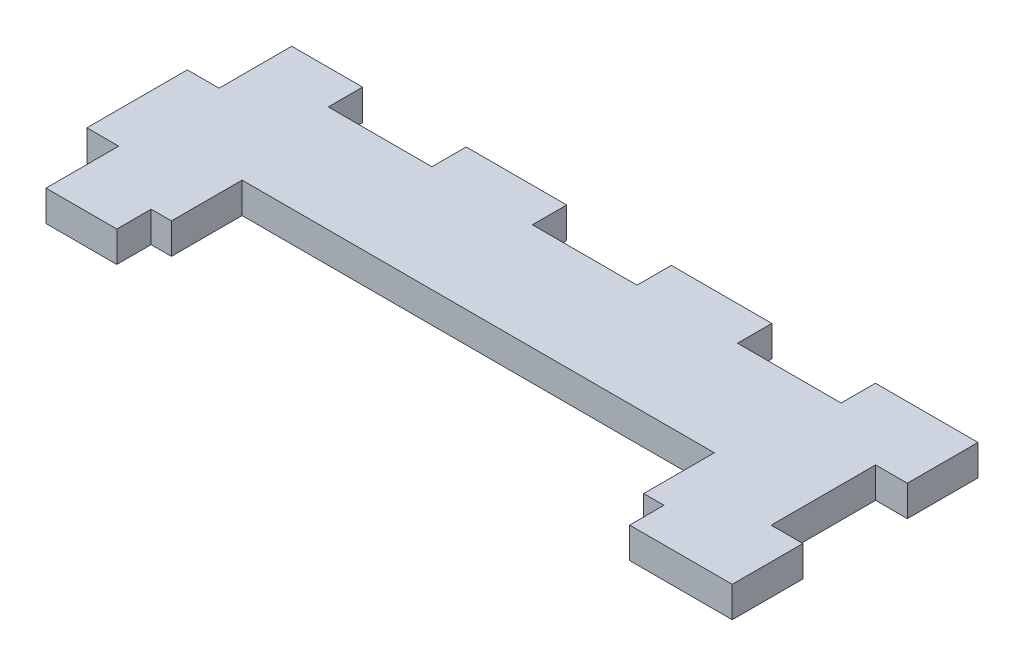
ISO-10303-21;
HEADER;
FILE_DESCRIPTION(('STEP AP214'),'2;1');
FILE_NAME('part.step','',(''),(''),'','','');
FILE_SCHEMA(('AUTOMOTIVE_DESIGN { 1 0 10303 214 1 1 1 1 }'));
ENDSEC;
DATA;
#1=APPLICATION_CONTEXT('core data for automotive mechanical design processes');
#2=APPLICATION_PROTOCOL_DEFINITION('international standard','automotive_design',2000,#1);
#3=PRODUCT_CONTEXT('',#1,'mechanical');
#4=PRODUCT('Part','Part','',(#3));
#5=PRODUCT_RELATED_PRODUCT_CATEGORY('part','',(#4));
#6=PRODUCT_DEFINITION_FORMATION('','',#4);
#7=PRODUCT_DEFINITION_CONTEXT('part definition',#1,'design');
#8=PRODUCT_DEFINITION('design','',#6,#7);
#9=PRODUCT_DEFINITION_SHAPE('','',#8);
#10=(LENGTH_UNIT() NAMED_UNIT(*) SI_UNIT(.MILLI.,.METRE.));
#11=(NAMED_UNIT(*) PLANE_ANGLE_UNIT() SI_UNIT($,.RADIAN.));
#12=(NAMED_UNIT(*) SI_UNIT($,.STERADIAN.) SOLID_ANGLE_UNIT());
#13=UNCERTAINTY_MEASURE_WITH_UNIT(LENGTH_MEASURE(1.E-05),#10,'distance_accuracy_value','');
#14=(GEOMETRIC_REPRESENTATION_CONTEXT(3) GLOBAL_UNCERTAINTY_ASSIGNED_CONTEXT((#13)) GLOBAL_UNIT_ASSIGNED_CONTEXT((#10,
#11,#12)) REPRESENTATION_CONTEXT('',''));
#15=CARTESIAN_POINT('',(0.,0.,0.));
#16=DIRECTION('',(0.,0.,1.));
#17=DIRECTION('',(1.,0.,0.));
#18=AXIS2_PLACEMENT_3D('',#15,#16,#17);
#19=CARTESIAN_POINT('',(-35.0584524881302,-3.00000000000002,-17.4));
#20=DIRECTION('',(0.,0.,-1.));
#21=DIRECTION('',(-1.,0.,0.));
#22=AXIS2_PLACEMENT_3D('',#19,#20,#21);
#23=PLANE('',#22);
#24=DIRECTION('',(-1.,0.,0.));
#25=VECTOR('',#24,1.);
#26=CARTESIAN_POINT('',(-35.0584524881302,0.,-17.4));
#27=LINE('',#26,#25);
#28=CARTESIAN_POINT('',(-31.9584524881302,0.,-17.4));
#29=VERTEX_POINT('',#28);
#30=CARTESIAN_POINT('',(-35.0584524881302,0.,-17.4));
#31=VERTEX_POINT('',#30);
#32=EDGE_CURVE('E274',#29,#31,#27,.T.);
#33=ORIENTED_EDGE('',*,*,#32,.F.);
#34=DIRECTION('',(0.,1.,0.));
#35=VECTOR('',#34,1.);
#36=CARTESIAN_POINT('',(-31.9584524881302,-3.00000000000002,-17.4));
#37=LINE('',#36,#35);
#38=CARTESIAN_POINT('',(-31.9584524881302,-3.00000000000002,-17.4));
#39=VERTEX_POINT('',#38);
#40=EDGE_CURVE('E11',#39,#29,#37,.T.);
#41=ORIENTED_EDGE('',*,*,#40,.F.);
#42=DIRECTION('',(-1.,0.,0.));
#43=VECTOR('',#42,1.);
#44=CARTESIAN_POINT('',(-35.0584524881302,-3.00000000000002,-17.4));
#45=LINE('',#44,#43);
#46=CARTESIAN_POINT('',(-35.0584524881302,-3.00000000000002,-17.4));
#47=VERTEX_POINT('',#46);
#48=EDGE_CURVE('E366',#39,#47,#45,.T.);
#49=ORIENTED_EDGE('',*,*,#48,.T.);
#50=DIRECTION('',(0.,1.,0.));
#51=VECTOR('',#50,1.);
#52=CARTESIAN_POINT('',(-35.0584524881302,-3.00000000000002,-17.4));
#53=LINE('',#52,#51);
#54=EDGE_CURVE('E36',#47,#31,#53,.T.);
#55=ORIENTED_EDGE('',*,*,#54,.T.);
#56=EDGE_LOOP('',(#33,#41,#49,#55));
#57=FACE_BOUND('',#56,.T.);
#58=ADVANCED_FACE('F33',(#57),#23,.T.);
#59=CARTESIAN_POINT('',(-31.9584524881302,-3.00000000000002,-17.4));
#60=DIRECTION('',(-1.,0.,0.));
#61=DIRECTION('',(0.,0.,1.));
#62=AXIS2_PLACEMENT_3D('',#59,#60,#61);
#63=PLANE('',#62);
#64=DIRECTION('',(0.,0.,1.));
#65=VECTOR('',#64,1.);
#66=CARTESIAN_POINT('',(-31.9584524881302,0.,-17.4));
#67=LINE('',#66,#65);
#68=CARTESIAN_POINT('',(-31.9584524881302,0.,-24.5));
#69=VERTEX_POINT('',#68);
#70=EDGE_CURVE('E364',#69,#29,#67,.T.);
#71=ORIENTED_EDGE('',*,*,#70,.F.);
#72=DIRECTION('',(0.,1.,0.));
#73=VECTOR('',#72,1.);
#74=CARTESIAN_POINT('',(-31.9584524881302,-3.00000000000002,-24.5));
#75=LINE('',#74,#73);
#76=CARTESIAN_POINT('',(-31.9584524881302,-3.00000000000002,-24.5));
#77=VERTEX_POINT('',#76);
#78=EDGE_CURVE('E42',#77,#69,#75,.T.);
#79=ORIENTED_EDGE('',*,*,#78,.F.);
#80=DIRECTION('',(0.,0.,1.));
#81=VECTOR('',#80,1.);
#82=CARTESIAN_POINT('',(-31.9584524881302,-3.00000000000002,-17.4));
#83=LINE('',#82,#81);
#84=EDGE_CURVE('E264',#77,#39,#83,.T.);
#85=ORIENTED_EDGE('',*,*,#84,.T.);
#86=ORIENTED_EDGE('',*,*,#40,.T.);
#87=EDGE_LOOP('',(#71,#79,#85,#86));
#88=FACE_BOUND('',#87,.T.);
#89=ADVANCED_FACE('F426',(#88),#63,.T.);
#90=CARTESIAN_POINT('',(-31.9584524881302,-3.00000000000002,-24.5));
#91=DIRECTION('',(0.,0.,-1.));
#92=DIRECTION('',(-1.,0.,0.));
#93=AXIS2_PLACEMENT_3D('',#90,#91,#92);
#94=PLANE('',#93);
#95=DIRECTION('',(-1.,0.,0.));
#96=VECTOR('',#95,1.);
#97=CARTESIAN_POINT('',(-31.9584524881302,0.,-24.5));
#98=LINE('',#97,#96);
#99=CARTESIAN_POINT('',(-25.0417517772359,0.,-24.5));
#100=VERTEX_POINT('',#99);
#101=EDGE_CURVE('E251',#100,#69,#98,.T.);
#102=ORIENTED_EDGE('',*,*,#101,.F.);
#103=DIRECTION('',(0.,1.,0.));
#104=VECTOR('',#103,1.);
#105=CARTESIAN_POINT('',(-25.0417517772359,-3.00000000000002,-24.5));
#106=LINE('',#105,#104);
#107=CARTESIAN_POINT('',(-25.0417517772359,-3.00000000000002,-24.5));
#108=VERTEX_POINT('',#107);
#109=EDGE_CURVE('E246',#108,#100,#106,.T.);
#110=ORIENTED_EDGE('',*,*,#109,.F.);
#111=DIRECTION('',(-1.,0.,0.));
#112=VECTOR('',#111,1.);
#113=CARTESIAN_POINT('',(-31.9584524881302,-3.00000000000002,-24.5));
#114=LINE('',#113,#112);
#115=EDGE_CURVE('E249',#108,#77,#114,.T.);
#116=ORIENTED_EDGE('',*,*,#115,.T.);
#117=ORIENTED_EDGE('',*,*,#78,.T.);
#118=EDGE_LOOP('',(#102,#110,#116,#117));
#119=FACE_BOUND('',#118,.T.);
#120=ADVANCED_FACE('F248',(#119),#94,.T.);
#121=CARTESIAN_POINT('',(-25.0417517772359,-3.00000000000002,-24.5));
#122=DIRECTION('',(1.,0.,0.));
#123=DIRECTION('',(0.,0.,-1.));
#124=AXIS2_PLACEMENT_3D('',#121,#122,#123);
#125=PLANE('',#124);
#126=DIRECTION('',(0.,0.,-1.));
#127=VECTOR('',#126,1.);
#128=CARTESIAN_POINT('',(-25.0417517772359,0.,-24.5));
#129=LINE('',#128,#127);
#130=CARTESIAN_POINT('',(-25.0417517772359,0.,-21.15));
#131=VERTEX_POINT('',#130);
#132=EDGE_CURVE('E361',#131,#100,#129,.T.);
#133=ORIENTED_EDGE('',*,*,#132,.F.);
#134=DIRECTION('',(0.,1.,0.));
#135=VECTOR('',#134,1.);
#136=CARTESIAN_POINT('',(-25.0417517772359,-3.00000000000002,-21.15));
#137=LINE('',#136,#135);
#138=CARTESIAN_POINT('',(-25.0417517772359,-3.00000000000002,-21.15));
#139=VERTEX_POINT('',#138);
#140=EDGE_CURVE('E256',#139,#131,#137,.T.);
#141=ORIENTED_EDGE('',*,*,#140,.F.);
#142=DIRECTION('',(0.,0.,-1.));
#143=VECTOR('',#142,1.);
#144=CARTESIAN_POINT('',(-25.0417517772359,-3.00000000000002,-24.5));
#145=LINE('',#144,#143);
#146=EDGE_CURVE('E262',#139,#108,#145,.T.);
#147=ORIENTED_EDGE('',*,*,#146,.T.);
#148=ORIENTED_EDGE('',*,*,#109,.T.);
#149=EDGE_LOOP('',(#133,#141,#147,#148));
#150=FACE_BOUND('',#149,.T.);
#151=ADVANCED_FACE('F266',(#150),#125,.T.);
#152=CARTESIAN_POINT('',(-25.0417517772359,-3.00000000000002,-21.15));
#153=DIRECTION('',(0.,0.,-1.));
#154=DIRECTION('',(-1.,0.,0.));
#155=AXIS2_PLACEMENT_3D('',#152,#153,#154);
#156=PLANE('',#155);
#157=DIRECTION('',(-1.,0.,0.));
#158=VECTOR('',#157,1.);
#159=CARTESIAN_POINT('',(-25.0417517772359,0.,-21.15));
#160=LINE('',#159,#158);
#161=CARTESIAN_POINT('',(-14.9250510663415,0.,-21.15));
#162=VERTEX_POINT('',#161);
#163=EDGE_CURVE('E358',#162,#131,#160,.T.);
#164=ORIENTED_EDGE('',*,*,#163,.F.);
#165=DIRECTION('',(0.,1.,0.));
#166=VECTOR('',#165,1.);
#167=CARTESIAN_POINT('',(-14.9250510663415,-3.00000000000002,-21.15));
#168=LINE('',#167,#166);
#169=CARTESIAN_POINT('',(-14.9250510663415,-3.00000000000002,-21.15));
#170=VERTEX_POINT('',#169);
#171=EDGE_CURVE('E370',#170,#162,#168,.T.);
#172=ORIENTED_EDGE('',*,*,#171,.F.);
#173=DIRECTION('',(-1.,0.,0.));
#174=VECTOR('',#173,1.);
#175=CARTESIAN_POINT('',(-25.0417517772359,-3.00000000000002,-21.15));
#176=LINE('',#175,#174);
#177=EDGE_CURVE('E267',#170,#139,#176,.T.);
#178=ORIENTED_EDGE('',*,*,#177,.T.);
#179=ORIENTED_EDGE('',*,*,#140,.T.);
#180=EDGE_LOOP('',(#164,#172,#178,#179));
#181=FACE_BOUND('',#180,.T.);
#182=ADVANCED_FACE('F439',(#181),#156,.T.);
#183=CARTESIAN_POINT('',(-14.9250510663415,-3.00000000000002,-21.15));
#184=DIRECTION('',(-1.,0.,0.));
#185=DIRECTION('',(0.,0.,1.));
#186=AXIS2_PLACEMENT_3D('',#183,#184,#185);
#187=PLANE('',#186);
#188=DIRECTION('',(0.,0.,1.));
#189=VECTOR('',#188,1.);
#190=CARTESIAN_POINT('',(-14.9250510663415,0.,-21.15));
#191=LINE('',#190,#189);
#192=CARTESIAN_POINT('',(-14.9250510663415,0.,-24.5));
#193=VERTEX_POINT('',#192);
#194=EDGE_CURVE('E355',#193,#162,#191,.T.);
#195=ORIENTED_EDGE('',*,*,#194,.F.);
#196=DIRECTION('',(0.,1.,0.));
#197=VECTOR('',#196,1.);
#198=CARTESIAN_POINT('',(-14.9250510663415,-3.00000000000002,-24.5));
#199=LINE('',#198,#197);
#200=CARTESIAN_POINT('',(-14.9250510663415,-3.00000000000002,-24.5));
#201=VERTEX_POINT('',#200);
#202=EDGE_CURVE('E372',#201,#193,#199,.T.);
#203=ORIENTED_EDGE('',*,*,#202,.F.);
#204=DIRECTION('',(0.,0.,1.));
#205=VECTOR('',#204,1.);
#206=CARTESIAN_POINT('',(-14.9250510663415,-3.00000000000002,-21.15));
#207=LINE('',#206,#205);
#208=EDGE_CURVE('E269',#201,#170,#207,.T.);
#209=ORIENTED_EDGE('',*,*,#208,.T.);
#210=ORIENTED_EDGE('',*,*,#171,.T.);
#211=EDGE_LOOP('',(#195,#203,#209,#210));
#212=FACE_BOUND('',#211,.T.);
#213=ADVANCED_FACE('F442',(#212),#187,.T.);
#214=CARTESIAN_POINT('',(-14.9250510663415,-3.00000000000002,-24.5));
#215=DIRECTION('',(0.,0.,-1.));
#216=DIRECTION('',(-1.,0.,0.));
#217=AXIS2_PLACEMENT_3D('',#214,#215,#216);
#218=PLANE('',#217);
#219=DIRECTION('',(-1.,0.,0.));
#220=VECTOR('',#219,1.);
#221=CARTESIAN_POINT('',(-14.9250510663415,0.,-24.5));
#222=LINE('',#221,#220);
#223=CARTESIAN_POINT('',(-5.10835035544714,0.,-24.5));
#224=VERTEX_POINT('',#223);
#225=EDGE_CURVE('E352',#224,#193,#222,.T.);
#226=ORIENTED_EDGE('',*,*,#225,.F.);
#227=DIRECTION('',(0.,1.,0.));
#228=VECTOR('',#227,1.);
#229=CARTESIAN_POINT('',(-5.10835035544714,-3.00000000000002,-24.5));
#230=LINE('',#229,#228);
#231=CARTESIAN_POINT('',(-5.10835035544714,-3.00000000000002,-24.5));
#232=VERTEX_POINT('',#231);
#233=EDGE_CURVE('E374',#232,#224,#230,.T.);
#234=ORIENTED_EDGE('',*,*,#233,.F.);
#235=DIRECTION('',(-1.,0.,0.));
#236=VECTOR('',#235,1.);
#237=CARTESIAN_POINT('',(-14.9250510663415,-3.00000000000002,-24.5));
#238=LINE('',#237,#236);
#239=EDGE_CURVE('E845',#232,#201,#238,.T.);
#240=ORIENTED_EDGE('',*,*,#239,.T.);
#241=ORIENTED_EDGE('',*,*,#202,.T.);
#242=EDGE_LOOP('',(#226,#234,#240,#241));
#243=FACE_BOUND('',#242,.T.);
#244=ADVANCED_FACE('F446',(#243),#218,.T.);
#245=CARTESIAN_POINT('',(-5.10835035544714,-3.00000000000002,-24.5));
#246=DIRECTION('',(1.,0.,0.));
#247=DIRECTION('',(0.,0.,-1.));
#248=AXIS2_PLACEMENT_3D('',#245,#246,#247);
#249=PLANE('',#248);
#250=DIRECTION('',(0.,0.,-1.));
#251=VECTOR('',#250,1.);
#252=CARTESIAN_POINT('',(-5.10835035544714,0.,-24.5));
#253=LINE('',#252,#251);
#254=CARTESIAN_POINT('',(-5.10835035544714,0.,-21.15));
#255=VERTEX_POINT('',#254);
#256=EDGE_CURVE('E349',#255,#224,#253,.T.);
#257=ORIENTED_EDGE('',*,*,#256,.F.);
#258=DIRECTION('',(0.,1.,0.));
#259=VECTOR('',#258,1.);
#260=CARTESIAN_POINT('',(-5.10835035544714,-3.00000000000002,-21.15));
#261=LINE('',#260,#259);
#262=CARTESIAN_POINT('',(-5.10835035544714,-3.00000000000002,-21.15));
#263=VERTEX_POINT('',#262);
#264=EDGE_CURVE('E376',#263,#255,#261,.T.);
#265=ORIENTED_EDGE('',*,*,#264,.F.);
#266=DIRECTION('',(0.,0.,-1.));
#267=VECTOR('',#266,1.);
#268=CARTESIAN_POINT('',(-5.10835035544714,-3.00000000000002,-24.5));
#269=LINE('',#268,#267);
#270=EDGE_CURVE('E838',#263,#232,#269,.T.);
#271=ORIENTED_EDGE('',*,*,#270,.T.);
#272=ORIENTED_EDGE('',*,*,#233,.T.);
#273=EDGE_LOOP('',(#257,#265,#271,#272));
#274=FACE_BOUND('',#273,.T.);
#275=ADVANCED_FACE('F450',(#274),#249,.T.);
#276=CARTESIAN_POINT('',(-5.10835035544714,-3.00000000000002,-21.15));
#277=DIRECTION('',(0.,0.,-1.));
#278=DIRECTION('',(-1.,0.,0.));
#279=AXIS2_PLACEMENT_3D('',#276,#277,#278);
#280=PLANE('',#279);
#281=DIRECTION('',(-1.,0.,0.));
#282=VECTOR('',#281,1.);
#283=CARTESIAN_POINT('',(-5.10835035544714,0.,-21.15));
#284=LINE('',#283,#282);
#285=CARTESIAN_POINT('',(5.10835035544714,0.,-21.15));
#286=VERTEX_POINT('',#285);
#287=EDGE_CURVE('E346',#286,#255,#284,.T.);
#288=ORIENTED_EDGE('',*,*,#287,.F.);
#289=DIRECTION('',(0.,1.,0.));
#290=VECTOR('',#289,1.);
#291=CARTESIAN_POINT('',(5.10835035544714,-3.00000000000002,-21.15));
#292=LINE('',#291,#290);
#293=CARTESIAN_POINT('',(5.10835035544714,-3.00000000000002,-21.15));
#294=VERTEX_POINT('',#293);
#295=EDGE_CURVE('E378',#294,#286,#292,.T.);
#296=ORIENTED_EDGE('',*,*,#295,.F.);
#297=DIRECTION('',(-1.,0.,0.));
#298=VECTOR('',#297,1.);
#299=CARTESIAN_POINT('',(-5.10835035544714,-3.00000000000002,-21.15));
#300=LINE('',#299,#298);
#301=EDGE_CURVE('E834',#294,#263,#300,.T.);
#302=ORIENTED_EDGE('',*,*,#301,.T.);
#303=ORIENTED_EDGE('',*,*,#264,.T.);
#304=EDGE_LOOP('',(#288,#296,#302,#303));
#305=FACE_BOUND('',#304,.T.);
#306=ADVANCED_FACE('F454',(#305),#280,.T.);
#307=CARTESIAN_POINT('',(5.10835035544714,-3.00000000000002,-21.15));
#308=DIRECTION('',(-1.,0.,0.));
#309=DIRECTION('',(0.,0.,1.));
#310=AXIS2_PLACEMENT_3D('',#307,#308,#309);
#311=PLANE('',#310);
#312=DIRECTION('',(0.,0.,1.));
#313=VECTOR('',#312,1.);
#314=CARTESIAN_POINT('',(5.10835035544714,0.,-21.15));
#315=LINE('',#314,#313);
#316=CARTESIAN_POINT('',(5.10835035544714,0.,-24.5));
#317=VERTEX_POINT('',#316);
#318=EDGE_CURVE('E343',#317,#286,#315,.T.);
#319=ORIENTED_EDGE('',*,*,#318,.F.);
#320=DIRECTION('',(0.,1.,0.));
#321=VECTOR('',#320,1.);
#322=CARTESIAN_POINT('',(5.10835035544714,-3.00000000000002,-24.5));
#323=LINE('',#322,#321);
#324=CARTESIAN_POINT('',(5.10835035544714,-3.00000000000002,-24.5));
#325=VERTEX_POINT('',#324);
#326=EDGE_CURVE('E380',#325,#317,#323,.T.);
#327=ORIENTED_EDGE('',*,*,#326,.F.);
#328=DIRECTION('',(0.,0.,1.));
#329=VECTOR('',#328,1.);
#330=CARTESIAN_POINT('',(5.10835035544714,-3.00000000000002,-21.15));
#331=LINE('',#330,#329);
#332=EDGE_CURVE('E850',#325,#294,#331,.T.);
#333=ORIENTED_EDGE('',*,*,#332,.T.);
#334=ORIENTED_EDGE('',*,*,#295,.T.);
#335=EDGE_LOOP('',(#319,#327,#333,#334));
#336=FACE_BOUND('',#335,.T.);
#337=ADVANCED_FACE('F458',(#336),#311,.T.);
#338=CARTESIAN_POINT('',(5.10835035544714,-3.00000000000002,-24.5));
#339=DIRECTION('',(0.,0.,-1.));
#340=DIRECTION('',(-1.,0.,0.));
#341=AXIS2_PLACEMENT_3D('',#338,#339,#340);
#342=PLANE('',#341);
#343=DIRECTION('',(-1.,0.,0.));
#344=VECTOR('',#343,1.);
#345=CARTESIAN_POINT('',(5.10835035544714,0.,-24.5));
#346=LINE('',#345,#344);
#347=CARTESIAN_POINT('',(14.9250510663415,0.,-24.5));
#348=VERTEX_POINT('',#347);
#349=EDGE_CURVE('E340',#348,#317,#346,.T.);
#350=ORIENTED_EDGE('',*,*,#349,.F.);
#351=DIRECTION('',(0.,1.,0.));
#352=VECTOR('',#351,1.);
#353=CARTESIAN_POINT('',(14.9250510663415,-3.00000000000002,-24.5));
#354=LINE('',#353,#352);
#355=CARTESIAN_POINT('',(14.9250510663415,-3.00000000000002,-24.5));
#356=VERTEX_POINT('',#355);
#357=EDGE_CURVE('E382',#356,#348,#354,.T.);
#358=ORIENTED_EDGE('',*,*,#357,.F.);
#359=DIRECTION('',(-1.,0.,0.));
#360=VECTOR('',#359,1.);
#361=CARTESIAN_POINT('',(5.10835035544714,-3.00000000000002,-24.5));
#362=LINE('',#361,#360);
#363=EDGE_CURVE('E827',#356,#325,#362,.T.);
#364=ORIENTED_EDGE('',*,*,#363,.T.);
#365=ORIENTED_EDGE('',*,*,#326,.T.);
#366=EDGE_LOOP('',(#350,#358,#364,#365));
#367=FACE_BOUND('',#366,.T.);
#368=ADVANCED_FACE('F462',(#367),#342,.T.);
#369=CARTESIAN_POINT('',(14.9250510663415,-3.00000000000002,-24.5));
#370=DIRECTION('',(1.,0.,0.));
#371=DIRECTION('',(0.,0.,-1.));
#372=AXIS2_PLACEMENT_3D('',#369,#370,#371);
#373=PLANE('',#372);
#374=DIRECTION('',(0.,0.,-1.));
#375=VECTOR('',#374,1.);
#376=CARTESIAN_POINT('',(14.9250510663415,0.,-24.5));
#377=LINE('',#376,#375);
#378=CARTESIAN_POINT('',(14.9250510663415,0.,-21.15));
#379=VERTEX_POINT('',#378);
#380=EDGE_CURVE('E337',#379,#348,#377,.T.);
#381=ORIENTED_EDGE('',*,*,#380,.F.);
#382=DIRECTION('',(0.,1.,0.));
#383=VECTOR('',#382,1.);
#384=CARTESIAN_POINT('',(14.9250510663415,-3.00000000000002,-21.15));
#385=LINE('',#384,#383);
#386=CARTESIAN_POINT('',(14.9250510663415,-3.00000000000002,-21.15));
#387=VERTEX_POINT('',#386);
#388=EDGE_CURVE('E384',#387,#379,#385,.T.);
#389=ORIENTED_EDGE('',*,*,#388,.F.);
#390=DIRECTION('',(0.,0.,-1.));
#391=VECTOR('',#390,1.);
#392=CARTESIAN_POINT('',(14.9250510663415,-3.00000000000002,-24.5));
#393=LINE('',#392,#391);
#394=EDGE_CURVE('E823',#387,#356,#393,.T.);
#395=ORIENTED_EDGE('',*,*,#394,.T.);
#396=ORIENTED_EDGE('',*,*,#357,.T.);
#397=EDGE_LOOP('',(#381,#389,#395,#396));
#398=FACE_BOUND('',#397,.T.);
#399=ADVANCED_FACE('F466',(#398),#373,.T.);
#400=CARTESIAN_POINT('',(14.9250510663415,-3.00000000000002,-21.15));
#401=DIRECTION('',(0.,0.,-1.));
#402=DIRECTION('',(-1.,0.,0.));
#403=AXIS2_PLACEMENT_3D('',#400,#401,#402);
#404=PLANE('',#403);
#405=DIRECTION('',(-1.,0.,0.));
#406=VECTOR('',#405,1.);
#407=CARTESIAN_POINT('',(14.9250510663415,0.,-21.15));
#408=LINE('',#407,#406);
#409=CARTESIAN_POINT('',(25.0417517772359,0.,-21.15));
#410=VERTEX_POINT('',#409);
#411=EDGE_CURVE('E334',#410,#379,#408,.T.);
#412=ORIENTED_EDGE('',*,*,#411,.F.);
#413=DIRECTION('',(0.,1.,0.));
#414=VECTOR('',#413,1.);
#415=CARTESIAN_POINT('',(25.0417517772359,-3.00000000000002,-21.15));
#416=LINE('',#415,#414);
#417=CARTESIAN_POINT('',(25.0417517772359,-3.00000000000002,-21.15));
#418=VERTEX_POINT('',#417);
#419=EDGE_CURVE('E386',#418,#410,#416,.T.);
#420=ORIENTED_EDGE('',*,*,#419,.F.);
#421=DIRECTION('',(-1.,0.,0.));
#422=VECTOR('',#421,1.);
#423=CARTESIAN_POINT('',(14.9250510663415,-3.00000000000002,-21.15));
#424=LINE('',#423,#422);
#425=EDGE_CURVE('E854',#418,#387,#424,.T.);
#426=ORIENTED_EDGE('',*,*,#425,.T.);
#427=ORIENTED_EDGE('',*,*,#388,.T.);
#428=EDGE_LOOP('',(#412,#420,#426,#427));
#429=FACE_BOUND('',#428,.T.);
#430=ADVANCED_FACE('F470',(#429),#404,.T.);
#431=CARTESIAN_POINT('',(25.0417517772359,-3.00000000000002,-21.15));
#432=DIRECTION('',(-1.,0.,0.));
#433=DIRECTION('',(0.,0.,1.));
#434=AXIS2_PLACEMENT_3D('',#431,#432,#433);
#435=PLANE('',#434);
#436=DIRECTION('',(0.,0.,1.));
#437=VECTOR('',#436,1.);
#438=CARTESIAN_POINT('',(25.0417517772359,0.,-21.15));
#439=LINE('',#438,#437);
#440=CARTESIAN_POINT('',(25.0417517772359,0.,-24.5));
#441=VERTEX_POINT('',#440);
#442=EDGE_CURVE('E331',#441,#410,#439,.T.);
#443=ORIENTED_EDGE('',*,*,#442,.F.);
#444=DIRECTION('',(0.,1.,0.));
#445=VECTOR('',#444,1.);
#446=CARTESIAN_POINT('',(25.0417517772359,-3.00000000000002,-24.5));
#447=LINE('',#446,#445);
#448=CARTESIAN_POINT('',(25.0417517772359,-3.00000000000002,-24.5));
#449=VERTEX_POINT('',#448);
#450=EDGE_CURVE('E388',#449,#441,#447,.T.);
#451=ORIENTED_EDGE('',*,*,#450,.F.);
#452=DIRECTION('',(0.,0.,1.));
#453=VECTOR('',#452,1.);
#454=CARTESIAN_POINT('',(25.0417517772359,-3.00000000000002,-21.15));
#455=LINE('',#454,#453);
#456=EDGE_CURVE('E816',#449,#418,#455,.T.);
#457=ORIENTED_EDGE('',*,*,#456,.T.);
#458=ORIENTED_EDGE('',*,*,#419,.T.);
#459=EDGE_LOOP('',(#443,#451,#457,#458));
#460=FACE_BOUND('',#459,.T.);
#461=ADVANCED_FACE('F474',(#460),#435,.T.);
#462=CARTESIAN_POINT('',(25.0417517772359,-3.00000000000002,-24.5));
#463=DIRECTION('',(0.,0.,-1.));
#464=DIRECTION('',(-1.,0.,0.));
#465=AXIS2_PLACEMENT_3D('',#462,#463,#464);
#466=PLANE('',#465);
#467=DIRECTION('',(-1.,0.,0.));
#468=VECTOR('',#467,1.);
#469=CARTESIAN_POINT('',(25.0417517772359,0.,-24.5));
#470=LINE('',#469,#468);
#471=CARTESIAN_POINT('',(35.0584524881302,0.,-24.5));
#472=VERTEX_POINT('',#471);
#473=EDGE_CURVE('E328',#472,#441,#470,.T.);
#474=ORIENTED_EDGE('',*,*,#473,.F.);
#475=DIRECTION('',(0.,1.,0.));
#476=VECTOR('',#475,1.);
#477=CARTESIAN_POINT('',(35.0584524881302,-3.00000000000002,-24.5));
#478=LINE('',#477,#476);
#479=CARTESIAN_POINT('',(35.0584524881302,-3.00000000000002,-24.5));
#480=VERTEX_POINT('',#479);
#481=EDGE_CURVE('E390',#480,#472,#478,.T.);
#482=ORIENTED_EDGE('',*,*,#481,.F.);
#483=DIRECTION('',(-1.,0.,0.));
#484=VECTOR('',#483,1.);
#485=CARTESIAN_POINT('',(25.0417517772359,-3.00000000000002,-24.5));
#486=LINE('',#485,#484);
#487=EDGE_CURVE('E812',#480,#449,#486,.T.);
#488=ORIENTED_EDGE('',*,*,#487,.T.);
#489=ORIENTED_EDGE('',*,*,#450,.T.);
#490=EDGE_LOOP('',(#474,#482,#488,#489));
#491=FACE_BOUND('',#490,.T.);
#492=ADVANCED_FACE('F478',(#491),#466,.T.);
#493=CARTESIAN_POINT('',(35.0584524881302,-3.00000000000002,-24.5));
#494=DIRECTION('',(1.,0.,0.));
#495=DIRECTION('',(0.,0.,-1.));
#496=AXIS2_PLACEMENT_3D('',#493,#494,#495);
#497=PLANE('',#496);
#498=DIRECTION('',(0.,0.,-1.));
#499=VECTOR('',#498,1.);
#500=CARTESIAN_POINT('',(35.0584524881302,0.,-24.5));
#501=LINE('',#500,#499);
#502=CARTESIAN_POINT('',(35.0584524881302,0.,-17.6));
#503=VERTEX_POINT('',#502);
#504=EDGE_CURVE('E325',#503,#472,#501,.T.);
#505=ORIENTED_EDGE('',*,*,#504,.F.);
#506=DIRECTION('',(0.,1.,0.));
#507=VECTOR('',#506,1.);
#508=CARTESIAN_POINT('',(35.0584524881302,-3.00000000000002,-17.6));
#509=LINE('',#508,#507);
#510=CARTESIAN_POINT('',(35.0584524881302,-3.00000000000002,-17.6));
#511=VERTEX_POINT('',#510);
#512=EDGE_CURVE('E392',#511,#503,#509,.T.);
#513=ORIENTED_EDGE('',*,*,#512,.F.);
#514=DIRECTION('',(0.,0.,-1.));
#515=VECTOR('',#514,1.);
#516=CARTESIAN_POINT('',(35.0584524881302,-3.00000000000002,-24.5));
#517=LINE('',#516,#515);
#518=EDGE_CURVE('E858',#511,#480,#517,.T.);
#519=ORIENTED_EDGE('',*,*,#518,.T.);
#520=ORIENTED_EDGE('',*,*,#481,.T.);
#521=EDGE_LOOP('',(#505,#513,#519,#520));
#522=FACE_BOUND('',#521,.T.);
#523=ADVANCED_FACE('F482',(#522),#497,.T.);
#524=CARTESIAN_POINT('',(35.0584524881302,-3.00000000000002,-17.6));
#525=DIRECTION('',(0.,0.,1.));
#526=DIRECTION('',(1.,0.,0.));
#527=AXIS2_PLACEMENT_3D('',#524,#525,#526);
#528=PLANE('',#527);
#529=DIRECTION('',(1.,0.,0.));
#530=VECTOR('',#529,1.);
#531=CARTESIAN_POINT('',(35.0584524881302,0.,-17.6));
#532=LINE('',#531,#530);
#533=CARTESIAN_POINT('',(31.9584524881302,0.,-17.6));
#534=VERTEX_POINT('',#533);
#535=EDGE_CURVE('E322',#534,#503,#532,.T.);
#536=ORIENTED_EDGE('',*,*,#535,.F.);
#537=DIRECTION('',(0.,1.,0.));
#538=VECTOR('',#537,1.);
#539=CARTESIAN_POINT('',(31.9584524881302,-3.00000000000002,-17.6));
#540=LINE('',#539,#538);
#541=CARTESIAN_POINT('',(31.9584524881302,-3.00000000000002,-17.6));
#542=VERTEX_POINT('',#541);
#543=EDGE_CURVE('E394',#542,#534,#540,.T.);
#544=ORIENTED_EDGE('',*,*,#543,.F.);
#545=DIRECTION('',(1.,0.,0.));
#546=VECTOR('',#545,1.);
#547=CARTESIAN_POINT('',(35.0584524881302,-3.00000000000002,-17.6));
#548=LINE('',#547,#546);
#549=EDGE_CURVE('E805',#542,#511,#548,.T.);
#550=ORIENTED_EDGE('',*,*,#549,.T.);
#551=ORIENTED_EDGE('',*,*,#512,.T.);
#552=EDGE_LOOP('',(#536,#544,#550,#551));
#553=FACE_BOUND('',#552,.T.);
#554=ADVANCED_FACE('F486',(#553),#528,.T.);
#555=CARTESIAN_POINT('',(31.9584524881302,-3.00000000000002,-17.6));
#556=DIRECTION('',(1.,0.,0.));
#557=DIRECTION('',(0.,0.,-1.));
#558=AXIS2_PLACEMENT_3D('',#555,#556,#557);
#559=PLANE('',#558);
#560=DIRECTION('',(0.,0.,-1.));
#561=VECTOR('',#560,1.);
#562=CARTESIAN_POINT('',(31.9584524881302,0.,-17.6));
#563=LINE('',#562,#561);
#564=CARTESIAN_POINT('',(31.9584524881302,0.,-7.39999999999999));
#565=VERTEX_POINT('',#564);
#566=EDGE_CURVE('E319',#565,#534,#563,.T.);
#567=ORIENTED_EDGE('',*,*,#566,.F.);
#568=DIRECTION('',(0.,1.,0.));
#569=VECTOR('',#568,1.);
#570=CARTESIAN_POINT('',(31.9584524881302,-3.00000000000002,-7.39999999999999));
#571=LINE('',#570,#569);
#572=CARTESIAN_POINT('',(31.9584524881302,-3.00000000000002,-7.39999999999999));
#573=VERTEX_POINT('',#572);
#574=EDGE_CURVE('E396',#573,#565,#571,.T.);
#575=ORIENTED_EDGE('',*,*,#574,.F.);
#576=DIRECTION('',(0.,0.,-1.));
#577=VECTOR('',#576,1.);
#578=CARTESIAN_POINT('',(31.9584524881302,-3.00000000000002,-17.6));
#579=LINE('',#578,#577);
#580=EDGE_CURVE('E801',#573,#542,#579,.T.);
#581=ORIENTED_EDGE('',*,*,#580,.T.);
#582=ORIENTED_EDGE('',*,*,#543,.T.);
#583=EDGE_LOOP('',(#567,#575,#581,#582));
#584=FACE_BOUND('',#583,.T.);
#585=ADVANCED_FACE('F490',(#584),#559,.T.);
#586=CARTESIAN_POINT('',(31.9584524881302,-3.00000000000002,-7.39999999999999));
#587=DIRECTION('',(0.,0.,-1.));
#588=DIRECTION('',(-1.,0.,0.));
#589=AXIS2_PLACEMENT_3D('',#586,#587,#588);
#590=PLANE('',#589);
#591=DIRECTION('',(-1.,0.,0.));
#592=VECTOR('',#591,1.);
#593=CARTESIAN_POINT('',(31.9584524881302,0.,-7.39999999999999));
#594=LINE('',#593,#592);
#595=CARTESIAN_POINT('',(35.0584524881302,0.,-7.39999999999999));
#596=VERTEX_POINT('',#595);
#597=EDGE_CURVE('E316',#596,#565,#594,.T.);
#598=ORIENTED_EDGE('',*,*,#597,.F.);
#599=DIRECTION('',(0.,1.,0.));
#600=VECTOR('',#599,1.);
#601=CARTESIAN_POINT('',(35.0584524881302,-3.00000000000002,-7.39999999999999));
#602=LINE('',#601,#600);
#603=CARTESIAN_POINT('',(35.0584524881302,-3.00000000000002,-7.39999999999999));
#604=VERTEX_POINT('',#603);
#605=EDGE_CURVE('E398',#604,#596,#602,.T.);
#606=ORIENTED_EDGE('',*,*,#605,.F.);
#607=DIRECTION('',(-1.,0.,0.));
#608=VECTOR('',#607,1.);
#609=CARTESIAN_POINT('',(31.9584524881302,-3.00000000000002,-7.39999999999999));
#610=LINE('',#609,#608);
#611=EDGE_CURVE('E862',#604,#573,#610,.T.);
#612=ORIENTED_EDGE('',*,*,#611,.T.);
#613=ORIENTED_EDGE('',*,*,#574,.T.);
#614=EDGE_LOOP('',(#598,#606,#612,#613));
#615=FACE_BOUND('',#614,.T.);
#616=ADVANCED_FACE('F494',(#615),#590,.T.);
#617=CARTESIAN_POINT('',(35.0584524881302,-3.00000000000002,-7.39999999999999));
#618=DIRECTION('',(1.,0.,0.));
#619=DIRECTION('',(0.,0.,-1.));
#620=AXIS2_PLACEMENT_3D('',#617,#618,#619);
#621=PLANE('',#620);
#622=DIRECTION('',(0.,0.,-1.));
#623=VECTOR('',#622,1.);
#624=CARTESIAN_POINT('',(35.0584524881302,0.,-7.39999999999999));
#625=LINE('',#624,#623);
#626=CARTESIAN_POINT('',(35.0584524881302,0.,-0.500000000000004));
#627=VERTEX_POINT('',#626);
#628=EDGE_CURVE('E313',#627,#596,#625,.T.);
#629=ORIENTED_EDGE('',*,*,#628,.F.);
#630=DIRECTION('',(0.,1.,0.));
#631=VECTOR('',#630,1.);
#632=CARTESIAN_POINT('',(35.0584524881302,-3.00000000000002,-0.500000000000004));
#633=LINE('',#632,#631);
#634=CARTESIAN_POINT('',(35.0584524881302,-3.00000000000002,-0.500000000000004));
#635=VERTEX_POINT('',#634);
#636=EDGE_CURVE('E400',#635,#627,#633,.T.);
#637=ORIENTED_EDGE('',*,*,#636,.F.);
#638=DIRECTION('',(0.,0.,-1.));
#639=VECTOR('',#638,1.);
#640=CARTESIAN_POINT('',(35.0584524881302,-3.00000000000002,-7.39999999999999));
#641=LINE('',#640,#639);
#642=EDGE_CURVE('E794',#635,#604,#641,.T.);
#643=ORIENTED_EDGE('',*,*,#642,.T.);
#644=ORIENTED_EDGE('',*,*,#605,.T.);
#645=EDGE_LOOP('',(#629,#637,#643,#644));
#646=FACE_BOUND('',#645,.T.);
#647=ADVANCED_FACE('F498',(#646),#621,.T.);
#648=CARTESIAN_POINT('',(35.0584524881302,-3.00000000000002,-0.500000000000004));
#649=DIRECTION('',(0.,0.,1.));
#650=DIRECTION('',(1.,0.,0.));
#651=AXIS2_PLACEMENT_3D('',#648,#649,#650);
#652=PLANE('',#651);
#653=DIRECTION('',(1.,0.,0.));
#654=VECTOR('',#653,1.);
#655=CARTESIAN_POINT('',(35.0584524881302,0.,-0.500000000000004));
#656=LINE('',#655,#654);
#657=CARTESIAN_POINT('',(25.0417517772359,0.,-0.500000000000004));
#658=VERTEX_POINT('',#657);
#659=EDGE_CURVE('E310',#658,#627,#656,.T.);
#660=ORIENTED_EDGE('',*,*,#659,.F.);
#661=DIRECTION('',(0.,1.,0.));
#662=VECTOR('',#661,1.);
#663=CARTESIAN_POINT('',(25.0417517772359,-3.00000000000002,-0.500000000000004));
#664=LINE('',#663,#662);
#665=CARTESIAN_POINT('',(25.0417517772359,-3.00000000000002,-0.500000000000004));
#666=VERTEX_POINT('',#665);
#667=EDGE_CURVE('E402',#666,#658,#664,.T.);
#668=ORIENTED_EDGE('',*,*,#667,.F.);
#669=DIRECTION('',(1.,0.,0.));
#670=VECTOR('',#669,1.);
#671=CARTESIAN_POINT('',(35.0584524881302,-3.00000000000002,-0.500000000000004));
#672=LINE('',#671,#670);
#673=EDGE_CURVE('E790',#666,#635,#672,.T.);
#674=ORIENTED_EDGE('',*,*,#673,.T.);
#675=ORIENTED_EDGE('',*,*,#636,.T.);
#676=EDGE_LOOP('',(#660,#668,#674,#675));
#677=FACE_BOUND('',#676,.T.);
#678=ADVANCED_FACE('F502',(#677),#652,.T.);
#679=CARTESIAN_POINT('',(25.0417517772359,-3.00000000000002,-0.500000000000004));
#680=DIRECTION('',(-1.,0.,0.));
#681=DIRECTION('',(0.,0.,1.));
#682=AXIS2_PLACEMENT_3D('',#679,#680,#681);
#683=PLANE('',#682);
#684=DIRECTION('',(0.,0.,1.));
#685=VECTOR('',#684,1.);
#686=CARTESIAN_POINT('',(25.0417517772359,0.,-0.500000000000004));
#687=LINE('',#686,#685);
#688=CARTESIAN_POINT('',(25.0417517772359,0.,-3.85));
#689=VERTEX_POINT('',#688);
#690=EDGE_CURVE('E307',#689,#658,#687,.T.);
#691=ORIENTED_EDGE('',*,*,#690,.F.);
#692=DIRECTION('',(0.,1.,0.));
#693=VECTOR('',#692,1.);
#694=CARTESIAN_POINT('',(25.0417517772359,-3.00000000000002,-3.85));
#695=LINE('',#694,#693);
#696=CARTESIAN_POINT('',(25.0417517772359,-3.00000000000002,-3.85));
#697=VERTEX_POINT('',#696);
#698=EDGE_CURVE('E404',#697,#689,#695,.T.);
#699=ORIENTED_EDGE('',*,*,#698,.F.);
#700=DIRECTION('',(0.,0.,1.));
#701=VECTOR('',#700,1.);
#702=CARTESIAN_POINT('',(25.0417517772359,-3.00000000000002,-0.500000000000004));
#703=LINE('',#702,#701);
#704=EDGE_CURVE('E866',#697,#666,#703,.T.);
#705=ORIENTED_EDGE('',*,*,#704,.T.);
#706=ORIENTED_EDGE('',*,*,#667,.T.);
#707=EDGE_LOOP('',(#691,#699,#705,#706));
#708=FACE_BOUND('',#707,.T.);
#709=ADVANCED_FACE('F506',(#708),#683,.T.);
#710=CARTESIAN_POINT('',(25.0417517772359,-3.00000000000002,-3.85));
#711=DIRECTION('',(0.,0.,1.));
#712=DIRECTION('',(1.,0.,0.));
#713=AXIS2_PLACEMENT_3D('',#710,#711,#712);
#714=PLANE('',#713);
#715=DIRECTION('',(1.,0.,0.));
#716=VECTOR('',#715,1.);
#717=CARTESIAN_POINT('',(25.0417517772359,0.,-3.85));
#718=LINE('',#717,#716);
#719=CARTESIAN_POINT('',(23.0584524881302,0.,-3.85));
#720=VERTEX_POINT('',#719);
#721=EDGE_CURVE('E304',#720,#689,#718,.T.);
#722=ORIENTED_EDGE('',*,*,#721,.F.);
#723=DIRECTION('',(0.,1.,0.));
#724=VECTOR('',#723,1.);
#725=CARTESIAN_POINT('',(23.0584524881302,-3.00000000000002,-3.85));
#726=LINE('',#725,#724);
#727=CARTESIAN_POINT('',(23.0584524881302,-3.00000000000002,-3.85));
#728=VERTEX_POINT('',#727);
#729=EDGE_CURVE('E406',#728,#720,#726,.T.);
#730=ORIENTED_EDGE('',*,*,#729,.F.);
#731=DIRECTION('',(1.,0.,0.));
#732=VECTOR('',#731,1.);
#733=CARTESIAN_POINT('',(25.0417517772359,-3.00000000000002,-3.85));
#734=LINE('',#733,#732);
#735=EDGE_CURVE('E783',#728,#697,#734,.T.);
#736=ORIENTED_EDGE('',*,*,#735,.T.);
#737=ORIENTED_EDGE('',*,*,#698,.T.);
#738=EDGE_LOOP('',(#722,#730,#736,#737));
#739=FACE_BOUND('',#738,.T.);
#740=ADVANCED_FACE('F510',(#739),#714,.T.);
#741=CARTESIAN_POINT('',(23.0584524881302,-3.00000000000002,-3.85));
#742=DIRECTION('',(-1.,0.,0.));
#743=DIRECTION('',(0.,0.,1.));
#744=AXIS2_PLACEMENT_3D('',#741,#742,#743);
#745=PLANE('',#744);
#746=DIRECTION('',(0.,0.,1.));
#747=VECTOR('',#746,1.);
#748=CARTESIAN_POINT('',(23.0584524881302,0.,-3.85));
#749=LINE('',#748,#747);
#750=CARTESIAN_POINT('',(23.0584524881302,0.,-10.75));
#751=VERTEX_POINT('',#750);
#752=EDGE_CURVE('E301',#751,#720,#749,.T.);
#753=ORIENTED_EDGE('',*,*,#752,.F.);
#754=DIRECTION('',(0.,1.,0.));
#755=VECTOR('',#754,1.);
#756=CARTESIAN_POINT('',(23.0584524881302,-3.00000000000002,-10.75));
#757=LINE('',#756,#755);
#758=CARTESIAN_POINT('',(23.0584524881302,-3.00000000000002,-10.75));
#759=VERTEX_POINT('',#758);
#760=EDGE_CURVE('E408',#759,#751,#757,.T.);
#761=ORIENTED_EDGE('',*,*,#760,.F.);
#762=DIRECTION('',(0.,0.,1.));
#763=VECTOR('',#762,1.);
#764=CARTESIAN_POINT('',(23.0584524881302,-3.00000000000002,-3.85));
#765=LINE('',#764,#763);
#766=EDGE_CURVE('E779',#759,#728,#765,.T.);
#767=ORIENTED_EDGE('',*,*,#766,.T.);
#768=ORIENTED_EDGE('',*,*,#729,.T.);
#769=EDGE_LOOP('',(#753,#761,#767,#768));
#770=FACE_BOUND('',#769,.T.);
#771=ADVANCED_FACE('F514',(#770),#745,.T.);
#772=CARTESIAN_POINT('',(-23.0584524881302,-3.00000000000002,-10.75));
#773=DIRECTION('',(0.,0.,1.));
#774=DIRECTION('',(1.,0.,0.));
#775=AXIS2_PLACEMENT_3D('',#772,#773,#774);
#776=PLANE('',#775);
#777=DIRECTION('',(1.,0.,0.));
#778=VECTOR('',#777,1.);
#779=CARTESIAN_POINT('',(-23.0584524881302,0.,-10.75));
#780=LINE('',#779,#778);
#781=CARTESIAN_POINT('',(-23.0584524881302,0.,-10.75));
#782=VERTEX_POINT('',#781);
#783=EDGE_CURVE('E298',#782,#751,#780,.T.);
#784=ORIENTED_EDGE('',*,*,#783,.F.);
#785=DIRECTION('',(0.,1.,0.));
#786=VECTOR('',#785,1.);
#787=CARTESIAN_POINT('',(-23.0584524881302,-3.00000000000002,-10.75));
#788=LINE('',#787,#786);
#789=CARTESIAN_POINT('',(-23.0584524881302,-3.00000000000002,-10.75));
#790=VERTEX_POINT('',#789);
#791=EDGE_CURVE('E410',#790,#782,#788,.T.);
#792=ORIENTED_EDGE('',*,*,#791,.F.);
#793=DIRECTION('',(1.,0.,0.));
#794=VECTOR('',#793,1.);
#795=CARTESIAN_POINT('',(-23.0584524881302,-3.00000000000002,-10.75));
#796=LINE('',#795,#794);
#797=EDGE_CURVE('E870',#790,#759,#796,.T.);
#798=ORIENTED_EDGE('',*,*,#797,.T.);
#799=ORIENTED_EDGE('',*,*,#760,.T.);
#800=EDGE_LOOP('',(#784,#792,#798,#799));
#801=FACE_BOUND('',#800,.T.);
#802=ADVANCED_FACE('F518',(#801),#776,.T.);
#803=CARTESIAN_POINT('',(-23.0584524881302,-3.00000000000002,-3.85));
#804=DIRECTION('',(1.,0.,0.));
#805=DIRECTION('',(0.,0.,-1.));
#806=AXIS2_PLACEMENT_3D('',#803,#804,#805);
#807=PLANE('',#806);
#808=DIRECTION('',(0.,0.,-1.));
#809=VECTOR('',#808,1.);
#810=CARTESIAN_POINT('',(-23.0584524881302,0.,-3.85));
#811=LINE('',#810,#809);
#812=CARTESIAN_POINT('',(-23.0584524881302,0.,-3.85));
#813=VERTEX_POINT('',#812);
#814=EDGE_CURVE('E295',#813,#782,#811,.T.);
#815=ORIENTED_EDGE('',*,*,#814,.F.);
#816=DIRECTION('',(0.,1.,0.));
#817=VECTOR('',#816,1.);
#818=CARTESIAN_POINT('',(-23.0584524881302,-3.00000000000002,-3.85));
#819=LINE('',#818,#817);
#820=CARTESIAN_POINT('',(-23.0584524881302,-3.00000000000002,-3.85));
#821=VERTEX_POINT('',#820);
#822=EDGE_CURVE('E412',#821,#813,#819,.T.);
#823=ORIENTED_EDGE('',*,*,#822,.F.);
#824=DIRECTION('',(0.,0.,-1.));
#825=VECTOR('',#824,1.);
#826=CARTESIAN_POINT('',(-23.0584524881302,-3.00000000000002,-3.85));
#827=LINE('',#826,#825);
#828=EDGE_CURVE('E772',#821,#790,#827,.T.);
#829=ORIENTED_EDGE('',*,*,#828,.T.);
#830=ORIENTED_EDGE('',*,*,#791,.T.);
#831=EDGE_LOOP('',(#815,#823,#829,#830));
#832=FACE_BOUND('',#831,.T.);
#833=ADVANCED_FACE('F522',(#832),#807,.T.);
#834=CARTESIAN_POINT('',(-25.0417517772359,-3.00000000000002,-3.85));
#835=DIRECTION('',(0.,0.,1.));
#836=DIRECTION('',(1.,0.,0.));
#837=AXIS2_PLACEMENT_3D('',#834,#835,#836);
#838=PLANE('',#837);
#839=DIRECTION('',(1.,0.,0.));
#840=VECTOR('',#839,1.);
#841=CARTESIAN_POINT('',(-25.0417517772359,0.,-3.85));
#842=LINE('',#841,#840);
#843=CARTESIAN_POINT('',(-25.0417517772359,0.,-3.85));
#844=VERTEX_POINT('',#843);
#845=EDGE_CURVE('E292',#844,#813,#842,.T.);
#846=ORIENTED_EDGE('',*,*,#845,.F.);
#847=DIRECTION('',(0.,1.,0.));
#848=VECTOR('',#847,1.);
#849=CARTESIAN_POINT('',(-25.0417517772359,-3.00000000000002,-3.85));
#850=LINE('',#849,#848);
#851=CARTESIAN_POINT('',(-25.0417517772359,-3.00000000000002,-3.85));
#852=VERTEX_POINT('',#851);
#853=EDGE_CURVE('E414',#852,#844,#850,.T.);
#854=ORIENTED_EDGE('',*,*,#853,.F.);
#855=DIRECTION('',(1.,0.,0.));
#856=VECTOR('',#855,1.);
#857=CARTESIAN_POINT('',(-25.0417517772359,-3.00000000000002,-3.85));
#858=LINE('',#857,#856);
#859=EDGE_CURVE('E768',#852,#821,#858,.T.);
#860=ORIENTED_EDGE('',*,*,#859,.T.);
#861=ORIENTED_EDGE('',*,*,#822,.T.);
#862=EDGE_LOOP('',(#846,#854,#860,#861));
#863=FACE_BOUND('',#862,.T.);
#864=ADVANCED_FACE('F526',(#863),#838,.T.);
#865=CARTESIAN_POINT('',(-25.0417517772359,-3.00000000000002,-0.500000000000004));
#866=DIRECTION('',(1.,0.,0.));
#867=DIRECTION('',(0.,0.,-1.));
#868=AXIS2_PLACEMENT_3D('',#865,#866,#867);
#869=PLANE('',#868);
#870=DIRECTION('',(0.,0.,-1.));
#871=VECTOR('',#870,1.);
#872=CARTESIAN_POINT('',(-25.0417517772359,0.,-0.500000000000004));
#873=LINE('',#872,#871);
#874=CARTESIAN_POINT('',(-25.0417517772359,0.,-0.500000000000004));
#875=VERTEX_POINT('',#874);
#876=EDGE_CURVE('E289',#875,#844,#873,.T.);
#877=ORIENTED_EDGE('',*,*,#876,.F.);
#878=DIRECTION('',(0.,1.,0.));
#879=VECTOR('',#878,1.);
#880=CARTESIAN_POINT('',(-25.0417517772359,-3.00000000000002,-0.500000000000004));
#881=LINE('',#880,#879);
#882=CARTESIAN_POINT('',(-25.0417517772359,-3.00000000000002,-0.500000000000004));
#883=VERTEX_POINT('',#882);
#884=EDGE_CURVE('E416',#883,#875,#881,.T.);
#885=ORIENTED_EDGE('',*,*,#884,.F.);
#886=DIRECTION('',(0.,0.,-1.));
#887=VECTOR('',#886,1.);
#888=CARTESIAN_POINT('',(-25.0417517772359,-3.00000000000002,-0.500000000000004));
#889=LINE('',#888,#887);
#890=EDGE_CURVE('E874',#883,#852,#889,.T.);
#891=ORIENTED_EDGE('',*,*,#890,.T.);
#892=ORIENTED_EDGE('',*,*,#853,.T.);
#893=EDGE_LOOP('',(#877,#885,#891,#892));
#894=FACE_BOUND('',#893,.T.);
#895=ADVANCED_FACE('F530',(#894),#869,.T.);
#896=CARTESIAN_POINT('',(-31.9584524881302,-3.00000000000002,-0.500000000000004));
#897=DIRECTION('',(0.,0.,1.));
#898=DIRECTION('',(1.,0.,0.));
#899=AXIS2_PLACEMENT_3D('',#896,#897,#898);
#900=PLANE('',#899);
#901=DIRECTION('',(1.,0.,0.));
#902=VECTOR('',#901,1.);
#903=CARTESIAN_POINT('',(-31.9584524881302,0.,-0.500000000000004));
#904=LINE('',#903,#902);
#905=CARTESIAN_POINT('',(-31.9584524881302,0.,-0.500000000000004));
#906=VERTEX_POINT('',#905);
#907=EDGE_CURVE('E286',#906,#875,#904,.T.);
#908=ORIENTED_EDGE('',*,*,#907,.F.);
#909=DIRECTION('',(0.,1.,0.));
#910=VECTOR('',#909,1.);
#911=CARTESIAN_POINT('',(-31.9584524881302,-3.00000000000002,-0.500000000000004));
#912=LINE('',#911,#910);
#913=CARTESIAN_POINT('',(-31.9584524881302,-3.00000000000002,-0.500000000000004));
#914=VERTEX_POINT('',#913);
#915=EDGE_CURVE('E418',#914,#906,#912,.T.);
#916=ORIENTED_EDGE('',*,*,#915,.F.);
#917=DIRECTION('',(1.,0.,0.));
#918=VECTOR('',#917,1.);
#919=CARTESIAN_POINT('',(-31.9584524881302,-3.00000000000002,-0.500000000000004));
#920=LINE('',#919,#918);
#921=EDGE_CURVE('E761',#914,#883,#920,.T.);
#922=ORIENTED_EDGE('',*,*,#921,.T.);
#923=ORIENTED_EDGE('',*,*,#884,.T.);
#924=EDGE_LOOP('',(#908,#916,#922,#923));
#925=FACE_BOUND('',#924,.T.);
#926=ADVANCED_FACE('F534',(#925),#900,.T.);
#927=CARTESIAN_POINT('',(-31.9584524881302,-3.00000000000002,-7.60000000000001));
#928=DIRECTION('',(-1.,0.,0.));
#929=DIRECTION('',(0.,0.,1.));
#930=AXIS2_PLACEMENT_3D('',#927,#928,#929);
#931=PLANE('',#930);
#932=DIRECTION('',(0.,0.,1.));
#933=VECTOR('',#932,1.);
#934=CARTESIAN_POINT('',(-31.9584524881302,0.,-7.60000000000001));
#935=LINE('',#934,#933);
#936=CARTESIAN_POINT('',(-31.9584524881302,0.,-7.60000000000001));
#937=VERTEX_POINT('',#936);
#938=EDGE_CURVE('E283',#937,#906,#935,.T.);
#939=ORIENTED_EDGE('',*,*,#938,.F.);
#940=DIRECTION('',(0.,1.,0.));
#941=VECTOR('',#940,1.);
#942=CARTESIAN_POINT('',(-31.9584524881302,-3.00000000000002,-7.60000000000001));
#943=LINE('',#942,#941);
#944=CARTESIAN_POINT('',(-31.9584524881302,-3.00000000000002,-7.60000000000001));
#945=VERTEX_POINT('',#944);
#946=EDGE_CURVE('E420',#945,#937,#943,.T.);
#947=ORIENTED_EDGE('',*,*,#946,.F.);
#948=DIRECTION('',(0.,0.,1.));
#949=VECTOR('',#948,1.);
#950=CARTESIAN_POINT('',(-31.9584524881302,-3.00000000000002,-7.60000000000001));
#951=LINE('',#950,#949);
#952=EDGE_CURVE('E757',#945,#914,#951,.T.);
#953=ORIENTED_EDGE('',*,*,#952,.T.);
#954=ORIENTED_EDGE('',*,*,#915,.T.);
#955=EDGE_LOOP('',(#939,#947,#953,#954));
#956=FACE_BOUND('',#955,.T.);
#957=ADVANCED_FACE('F538',(#956),#931,.T.);
#958=CARTESIAN_POINT('',(-35.0584524881302,-3.00000000000002,-7.60000000000001));
#959=DIRECTION('',(0.,0.,1.));
#960=DIRECTION('',(1.,0.,0.));
#961=AXIS2_PLACEMENT_3D('',#958,#959,#960);
#962=PLANE('',#961);
#963=DIRECTION('',(1.,0.,0.));
#964=VECTOR('',#963,1.);
#965=CARTESIAN_POINT('',(-35.0584524881302,0.,-7.60000000000001));
#966=LINE('',#965,#964);
#967=CARTESIAN_POINT('',(-35.0584524881302,0.,-7.60000000000001));
#968=VERTEX_POINT('',#967);
#969=EDGE_CURVE('E280',#968,#937,#966,.T.);
#970=ORIENTED_EDGE('',*,*,#969,.F.);
#971=DIRECTION('',(0.,1.,0.));
#972=VECTOR('',#971,1.);
#973=CARTESIAN_POINT('',(-35.0584524881302,-3.00000000000002,-7.60000000000001));
#974=LINE('',#973,#972);
#975=CARTESIAN_POINT('',(-35.0584524881302,-3.00000000000002,-7.60000000000001));
#976=VERTEX_POINT('',#975);
#977=EDGE_CURVE('E421',#976,#968,#974,.T.);
#978=ORIENTED_EDGE('',*,*,#977,.F.);
#979=DIRECTION('',(1.,0.,0.));
#980=VECTOR('',#979,1.);
#981=CARTESIAN_POINT('',(-35.0584524881302,-3.00000000000002,-7.60000000000001));
#982=LINE('',#981,#980);
#983=EDGE_CURVE('E878',#976,#945,#982,.T.);
#984=ORIENTED_EDGE('',*,*,#983,.T.);
#985=ORIENTED_EDGE('',*,*,#946,.T.);
#986=EDGE_LOOP('',(#970,#978,#984,#985));
#987=FACE_BOUND('',#986,.T.);
#988=ADVANCED_FACE('F542',(#987),#962,.T.);
#989=CARTESIAN_POINT('',(-35.0584524881302,-3.00000000000002,-17.4));
#990=DIRECTION('',(-1.,0.,0.));
#991=DIRECTION('',(0.,0.,1.));
#992=AXIS2_PLACEMENT_3D('',#989,#990,#991);
#993=PLANE('',#992);
#994=DIRECTION('',(0.,0.,1.));
#995=VECTOR('',#994,1.);
#996=CARTESIAN_POINT('',(-35.0584524881302,0.,-17.4));
#997=LINE('',#996,#995);
#998=EDGE_CURVE('E277',#31,#968,#997,.T.);
#999=ORIENTED_EDGE('',*,*,#998,.F.);
#1000=ORIENTED_EDGE('',*,*,#54,.F.);
#1001=DIRECTION('',(0.,0.,1.));
#1002=VECTOR('',#1001,1.);
#1003=CARTESIAN_POINT('',(-35.0584524881302,-3.00000000000002,-17.4));
#1004=LINE('',#1003,#1002);
#1005=EDGE_CURVE('E880',#47,#976,#1004,.T.);
#1006=ORIENTED_EDGE('',*,*,#1005,.T.);
#1007=ORIENTED_EDGE('',*,*,#977,.T.);
#1008=EDGE_LOOP('',(#999,#1000,#1006,#1007));
#1009=FACE_BOUND('',#1008,.T.);
#1010=ADVANCED_FACE('F423',(#1009),#993,.T.);
#1011=CARTESIAN_POINT('',(0.,-3.00000000000002,0.));
#1012=DIRECTION('',(0.,1.,0.));
#1013=DIRECTION('',(0.,0.,1.));
#1014=AXIS2_PLACEMENT_3D('',#1011,#1012,#1013);
#1015=PLANE('',#1014);
#1016=ORIENTED_EDGE('',*,*,#48,.F.);
#1017=ORIENTED_EDGE('',*,*,#84,.F.);
#1018=ORIENTED_EDGE('',*,*,#115,.F.);
#1019=ORIENTED_EDGE('',*,*,#146,.F.);
#1020=ORIENTED_EDGE('',*,*,#177,.F.);
#1021=ORIENTED_EDGE('',*,*,#208,.F.);
#1022=ORIENTED_EDGE('',*,*,#239,.F.);
#1023=ORIENTED_EDGE('',*,*,#270,.F.);
#1024=ORIENTED_EDGE('',*,*,#301,.F.);
#1025=ORIENTED_EDGE('',*,*,#332,.F.);
#1026=ORIENTED_EDGE('',*,*,#363,.F.);
#1027=ORIENTED_EDGE('',*,*,#394,.F.);
#1028=ORIENTED_EDGE('',*,*,#425,.F.);
#1029=ORIENTED_EDGE('',*,*,#456,.F.);
#1030=ORIENTED_EDGE('',*,*,#487,.F.);
#1031=ORIENTED_EDGE('',*,*,#518,.F.);
#1032=ORIENTED_EDGE('',*,*,#549,.F.);
#1033=ORIENTED_EDGE('',*,*,#580,.F.);
#1034=ORIENTED_EDGE('',*,*,#611,.F.);
#1035=ORIENTED_EDGE('',*,*,#642,.F.);
#1036=ORIENTED_EDGE('',*,*,#673,.F.);
#1037=ORIENTED_EDGE('',*,*,#704,.F.);
#1038=ORIENTED_EDGE('',*,*,#735,.F.);
#1039=ORIENTED_EDGE('',*,*,#766,.F.);
#1040=ORIENTED_EDGE('',*,*,#797,.F.);
#1041=ORIENTED_EDGE('',*,*,#828,.F.);
#1042=ORIENTED_EDGE('',*,*,#859,.F.);
#1043=ORIENTED_EDGE('',*,*,#890,.F.);
#1044=ORIENTED_EDGE('',*,*,#921,.F.);
#1045=ORIENTED_EDGE('',*,*,#952,.F.);
#1046=ORIENTED_EDGE('',*,*,#983,.F.);
#1047=ORIENTED_EDGE('',*,*,#1005,.F.);
#1048=EDGE_LOOP('',(#1016,#1017,#1018,#1019,#1020,#1021,#1022,#1023,#1024,#1025,#1026,#1027,
#1028,#1029,#1030,#1031,#1032,#1033,#1034,#1035,#1036,#1037,#1038,#1039,#1040,#1041,#1042,#1043,
#1044,#1045,#1046,#1047));
#1049=FACE_BOUND('',#1048,.T.);
#1050=ADVANCED_FACE('F260',(#1049),#1015,.F.);
#1051=CARTESIAN_POINT('',(0.,0.,0.));
#1052=DIRECTION('',(0.,1.,0.));
#1053=DIRECTION('',(0.,0.,1.));
#1054=AXIS2_PLACEMENT_3D('',#1051,#1052,#1053);
#1055=PLANE('',#1054);
#1056=ORIENTED_EDGE('',*,*,#32,.T.);
#1057=ORIENTED_EDGE('',*,*,#998,.T.);
#1058=ORIENTED_EDGE('',*,*,#969,.T.);
#1059=ORIENTED_EDGE('',*,*,#938,.T.);
#1060=ORIENTED_EDGE('',*,*,#907,.T.);
#1061=ORIENTED_EDGE('',*,*,#876,.T.);
#1062=ORIENTED_EDGE('',*,*,#845,.T.);
#1063=ORIENTED_EDGE('',*,*,#814,.T.);
#1064=ORIENTED_EDGE('',*,*,#783,.T.);
#1065=ORIENTED_EDGE('',*,*,#752,.T.);
#1066=ORIENTED_EDGE('',*,*,#721,.T.);
#1067=ORIENTED_EDGE('',*,*,#690,.T.);
#1068=ORIENTED_EDGE('',*,*,#659,.T.);
#1069=ORIENTED_EDGE('',*,*,#628,.T.);
#1070=ORIENTED_EDGE('',*,*,#597,.T.);
#1071=ORIENTED_EDGE('',*,*,#566,.T.);
#1072=ORIENTED_EDGE('',*,*,#535,.T.);
#1073=ORIENTED_EDGE('',*,*,#504,.T.);
#1074=ORIENTED_EDGE('',*,*,#473,.T.);
#1075=ORIENTED_EDGE('',*,*,#442,.T.);
#1076=ORIENTED_EDGE('',*,*,#411,.T.);
#1077=ORIENTED_EDGE('',*,*,#380,.T.);
#1078=ORIENTED_EDGE('',*,*,#349,.T.);
#1079=ORIENTED_EDGE('',*,*,#318,.T.);
#1080=ORIENTED_EDGE('',*,*,#287,.T.);
#1081=ORIENTED_EDGE('',*,*,#256,.T.);
#1082=ORIENTED_EDGE('',*,*,#225,.T.);
#1083=ORIENTED_EDGE('',*,*,#194,.T.);
#1084=ORIENTED_EDGE('',*,*,#163,.T.);
#1085=ORIENTED_EDGE('',*,*,#132,.T.);
#1086=ORIENTED_EDGE('',*,*,#101,.T.);
#1087=ORIENTED_EDGE('',*,*,#70,.T.);
#1088=EDGE_LOOP('',(#1056,#1057,#1058,#1059,#1060,#1061,#1062,#1063,#1064,#1065,#1066,#1067,
#1068,#1069,#1070,#1071,#1072,#1073,#1074,#1075,#1076,#1077,#1078,#1079,#1080,#1081,#1082,#1083,
#1084,#1085,#1086,#1087));
#1089=FACE_BOUND('',#1088,.T.);
#1090=ADVANCED_FACE('F425',(#1089),#1055,.T.);
#1091=CLOSED_SHELL('',(#58,#89,#120,#151,#182,#213,#244,#275,#306,#337,#368,#399,#430,#461,#492,
#523,#554,#585,#616,#647,#678,#709,#740,#771,#802,#833,#864,#895,#926,#957,#988,#1010,#1050,#1090));
#1092=MANIFOLD_SOLID_BREP('B2',#1091);
#1093=ADVANCED_BREP_SHAPE_REPRESENTATION('',(#18,#1092),#14);
#1094=SHAPE_DEFINITION_REPRESENTATION(#9,#1093);
ENDSEC;
END-ISO-10303-21;
